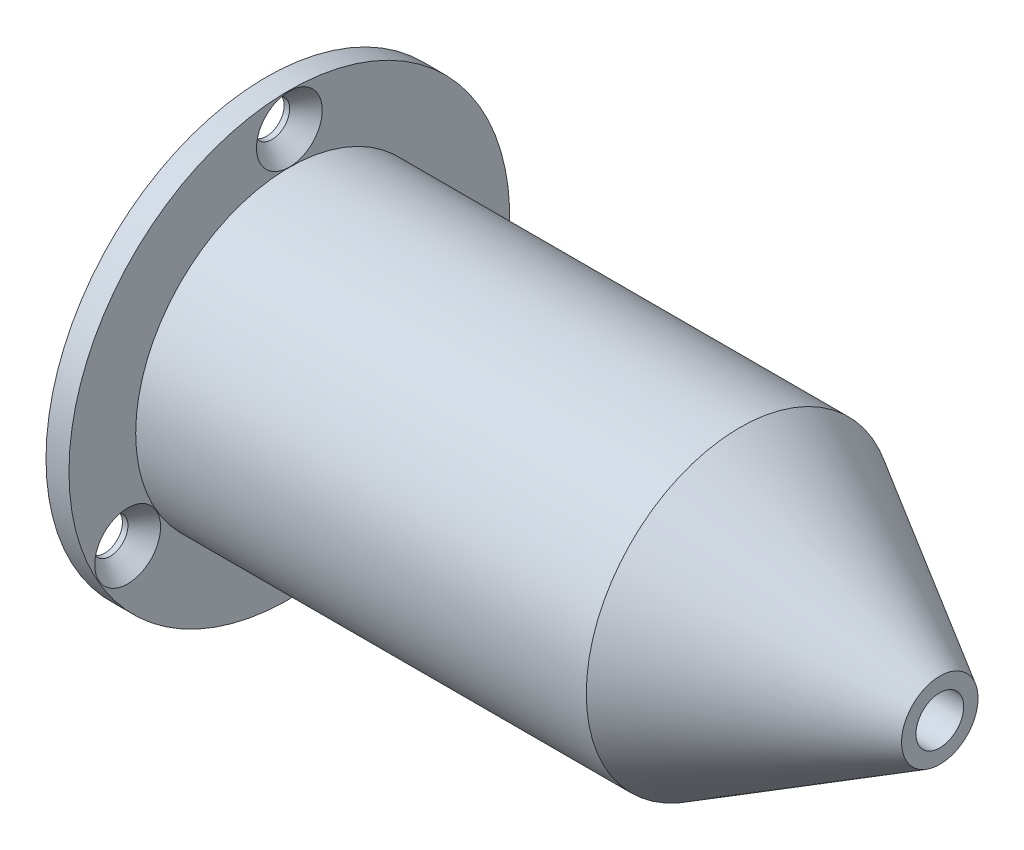
ISO-10303-21;
HEADER;
FILE_DESCRIPTION(('STEP AP214'),'2;1');
FILE_NAME('part.step','',(''),(''),'','','');
FILE_SCHEMA(('AUTOMOTIVE_DESIGN { 1 0 10303 214 1 1 1 1 }'));
ENDSEC;
DATA;
#1=APPLICATION_CONTEXT('core data for automotive mechanical design processes');
#2=APPLICATION_PROTOCOL_DEFINITION('international standard','automotive_design',2000,#1);
#3=PRODUCT_CONTEXT('',#1,'mechanical');
#4=PRODUCT('Part','Part','',(#3));
#5=PRODUCT_RELATED_PRODUCT_CATEGORY('part','',(#4));
#6=PRODUCT_DEFINITION_FORMATION('','',#4);
#7=PRODUCT_DEFINITION_CONTEXT('part definition',#1,'design');
#8=PRODUCT_DEFINITION('design','',#6,#7);
#9=PRODUCT_DEFINITION_SHAPE('','',#8);
#10=(LENGTH_UNIT() NAMED_UNIT(*) SI_UNIT(.MILLI.,.METRE.));
#11=(NAMED_UNIT(*) PLANE_ANGLE_UNIT() SI_UNIT($,.RADIAN.));
#12=(NAMED_UNIT(*) SI_UNIT($,.STERADIAN.) SOLID_ANGLE_UNIT());
#13=UNCERTAINTY_MEASURE_WITH_UNIT(LENGTH_MEASURE(1.E-05),#10,'distance_accuracy_value','');
#14=(GEOMETRIC_REPRESENTATION_CONTEXT(3) GLOBAL_UNCERTAINTY_ASSIGNED_CONTEXT((#13)) GLOBAL_UNIT_ASSIGNED_CONTEXT((#10,
#11,#12)) REPRESENTATION_CONTEXT('',''));
#15=CARTESIAN_POINT('',(0.,0.,0.));
#16=DIRECTION('',(0.,0.,1.));
#17=DIRECTION('',(1.,0.,0.));
#18=AXIS2_PLACEMENT_3D('',#15,#16,#17);
#19=CARTESIAN_POINT('',(38.142851058,0.,0.));
#20=DIRECTION('',(-1.,0.,0.));
#21=DIRECTION('',(0.,0.,1.));
#22=AXIS2_PLACEMENT_3D('',#19,#20,#21);
#23=CYLINDRICAL_SURFACE('',#22,12.2428);
#24=CARTESIAN_POINT('',(38.142851058,0.,0.));
#25=DIRECTION('',(-1.,0.,0.));
#26=DIRECTION('',(0.,0.,1.));
#27=AXIS2_PLACEMENT_3D('',#24,#25,#26);
#28=CIRCLE('',#27,12.2428);
#29=CARTESIAN_POINT('',(38.142851058,0.,12.2428));
#30=VERTEX_POINT('',#29);
#31=EDGE_CURVE('P0_E18',#30,#30,#28,.T.);
#32=ORIENTED_EDGE('',*,*,#31,.T.);
#33=EDGE_LOOP('',(#32));
#34=FACE_BOUND('',#33,.T.);
#35=CARTESIAN_POINT('',(38.1,0.,0.));
#36=DIRECTION('',(-1.,0.,0.));
#37=DIRECTION('',(0.,0.,1.));
#38=AXIS2_PLACEMENT_3D('',#35,#36,#37);
#39=CIRCLE('',#38,12.2428);
#40=CARTESIAN_POINT('',(38.1,0.,12.2428));
#41=VERTEX_POINT('',#40);
#42=EDGE_CURVE('P0_E32',#41,#41,#39,.F.);
#43=ORIENTED_EDGE('',*,*,#42,.T.);
#44=EDGE_LOOP('',(#43));
#45=FACE_BOUND('',#44,.T.);
#46=ADVANCED_FACE('P0_F14',(#34,#45),#23,.T.);
#47=CARTESIAN_POINT('',(38.142851058,-12.3897136,-12.3897136));
#48=DIRECTION('',(-1.,0.,0.));
#49=DIRECTION('',(0.,0.,1.));
#50=AXIS2_PLACEMENT_3D('',#47,#48,#49);
#51=PLANE('',#50);
#52=CARTESIAN_POINT('',(38.142851058,0.,0.));
#53=DIRECTION('',(1.,0.,0.));
#54=DIRECTION('',(0.,1.,0.));
#55=AXIS2_PLACEMENT_3D('',#52,#53,#54);
#56=CIRCLE('',#55,6.35);
#57=CARTESIAN_POINT('',(38.142851058,6.35,0.));
#58=VERTEX_POINT('',#57);
#59=EDGE_CURVE('P0_E23',#58,#58,#56,.T.);
#60=ORIENTED_EDGE('',*,*,#59,.F.);
#61=EDGE_LOOP('',(#60));
#62=FACE_BOUND('',#61,.T.);
#63=ORIENTED_EDGE('',*,*,#31,.F.);
#64=EDGE_LOOP('',(#63));
#65=FACE_BOUND('',#64,.T.);
#66=ADVANCED_FACE('P0_F41',(#62,#65),#51,.F.);
#67=CARTESIAN_POINT('',(38.1,-12.3897136,12.3897136));
#68=DIRECTION('',(1.,0.,0.));
#69=DIRECTION('',(0.,0.,-1.));
#70=AXIS2_PLACEMENT_3D('',#67,#68,#69);
#71=PLANE('',#70);
#72=CARTESIAN_POINT('',(38.1,0.,0.));
#73=DIRECTION('',(1.,0.,0.));
#74=DIRECTION('',(0.,1.,0.));
#75=AXIS2_PLACEMENT_3D('',#72,#73,#74);
#76=CIRCLE('',#75,6.35);
#77=CARTESIAN_POINT('',(38.1,6.35,0.));
#78=VERTEX_POINT('',#77);
#79=EDGE_CURVE('P0_E10',#78,#78,#76,.F.);
#80=ORIENTED_EDGE('',*,*,#79,.F.);
#81=EDGE_LOOP('',(#80));
#82=FACE_BOUND('',#81,.T.);
#83=ORIENTED_EDGE('',*,*,#42,.F.);
#84=EDGE_LOOP('',(#83));
#85=FACE_BOUND('',#84,.T.);
#86=ADVANCED_FACE('P0_F16',(#82,#85),#71,.F.);
#87=CARTESIAN_POINT('',(38.1,0.,0.));
#88=DIRECTION('',(1.,0.,0.));
#89=DIRECTION('',(0.,1.,0.));
#90=AXIS2_PLACEMENT_3D('',#87,#88,#89);
#91=CYLINDRICAL_SURFACE('',#90,6.35);
#92=ORIENTED_EDGE('',*,*,#79,.T.);
#93=EDGE_LOOP('',(#92));
#94=FACE_BOUND('',#93,.T.);
#95=ORIENTED_EDGE('',*,*,#59,.T.);
#96=EDGE_LOOP('',(#95));
#97=FACE_BOUND('',#96,.T.);
#98=ADVANCED_FACE('P0_F49',(#94,#97),#91,.F.);
#99=CLOSED_SHELL('',(#46,#66,#86,#98));
#100=MANIFOLD_SOLID_BREP('P0_B1',#99);
#101=CARTESIAN_POINT('',(42.592944206,-1.016225188,1.016225188));
#102=DIRECTION('',(1.,0.,0.));
#103=DIRECTION('',(0.,0.,-1.));
#104=AXIS2_PLACEMENT_3D('',#101,#102,#103);
#105=PLANE('',#104);
#106=CARTESIAN_POINT('',(42.592944206,0.,0.));
#107=DIRECTION('',(1.,0.,0.));
#108=DIRECTION('',(0.,0.,-1.));
#109=AXIS2_PLACEMENT_3D('',#106,#107,#108);
#110=CIRCLE('',#109,1.004175087);
#111=CARTESIAN_POINT('',(42.592944206,0.,-1.004175087));
#112=VERTEX_POINT('',#111);
#113=EDGE_CURVE('P1_E18',#112,#112,#110,.F.);
#114=ORIENTED_EDGE('',*,*,#113,.F.);
#115=EDGE_LOOP('',(#114));
#116=FACE_BOUND('',#115,.T.);
#117=ADVANCED_FACE('P1_F14',(#116),#105,.T.);
#118=CARTESIAN_POINT('',(42.592944206,0.,0.));
#119=DIRECTION('',(1.,0.,0.));
#120=DIRECTION('',(0.,0.,-1.));
#121=AXIS2_PLACEMENT_3D('',#118,#119,#120);
#122=CONICAL_SURFACE('',#121,1.004175087,1.02974425869962);
#123=CARTESIAN_POINT('',(43.18,0.,0.));
#124=DIRECTION('',(-1.,0.,0.));
#125=DIRECTION('',(0.,-1.,0.));
#126=AXIS2_PLACEMENT_3D('',#123,#124,#125);
#127=CIRCLE('',#126,1.9812);
#128=CARTESIAN_POINT('',(43.18,-1.9812,0.));
#129=VERTEX_POINT('',#128);
#130=EDGE_CURVE('P1_E36',#129,#129,#127,.T.);
#131=ORIENTED_EDGE('',*,*,#130,.F.);
#132=EDGE_LOOP('',(#131));
#133=FACE_BOUND('',#132,.T.);
#134=ORIENTED_EDGE('',*,*,#113,.T.);
#135=EDGE_LOOP('',(#134));
#136=FACE_BOUND('',#135,.T.);
#137=ADVANCED_FACE('P1_F95',(#133,#136),#122,.F.);
#138=CARTESIAN_POINT('',(55.88,0.,0.));
#139=DIRECTION('',(-1.,0.,0.));
#140=DIRECTION('',(0.,0.,1.));
#141=AXIS2_PLACEMENT_3D('',#138,#139,#140);
#142=CYLINDRICAL_SURFACE('',#141,1.9812);
#143=ORIENTED_EDGE('',*,*,#130,.T.);
#144=EDGE_LOOP('',(#143));
#145=FACE_BOUND('',#144,.T.);
#146=CARTESIAN_POINT('',(55.88,0.,0.));
#147=DIRECTION('',(-1.,0.,0.));
#148=DIRECTION('',(0.,0.,1.));
#149=AXIS2_PLACEMENT_3D('',#146,#147,#148);
#150=CIRCLE('',#149,1.9812);
#151=CARTESIAN_POINT('',(55.88,0.,1.9812));
#152=VERTEX_POINT('',#151);
#153=EDGE_CURVE('P1_E83',#152,#152,#150,.T.);
#154=ORIENTED_EDGE('',*,*,#153,.F.);
#155=EDGE_LOOP('',(#154));
#156=FACE_BOUND('',#155,.T.);
#157=ADVANCED_FACE('P1_F103',(#145,#156),#142,.F.);
#158=CARTESIAN_POINT('',(55.88,-3.213100005,3.213100005));
#159=DIRECTION('',(1.,0.,0.));
#160=DIRECTION('',(0.,0.,-1.));
#161=AXIS2_PLACEMENT_3D('',#158,#159,#160);
#162=PLANE('',#161);
#163=ORIENTED_EDGE('',*,*,#153,.T.);
#164=EDGE_LOOP('',(#163));
#165=FACE_BOUND('',#164,.T.);
#166=CARTESIAN_POINT('',(55.880000003,0.,0.));
#167=DIRECTION('',(-1.,0.,0.));
#168=DIRECTION('',(0.,0.,1.));
#169=AXIS2_PLACEMENT_3D('',#166,#167,#168);
#170=CIRCLE('',#169,3.17500000500001);
#171=CARTESIAN_POINT('',(55.880000003,0.,3.17500000500001));
#172=VERTEX_POINT('',#171);
#173=EDGE_CURVE('P1_E80',#172,#172,#170,.F.);
#174=ORIENTED_EDGE('',*,*,#173,.T.);
#175=EDGE_LOOP('',(#174));
#176=FACE_BOUND('',#175,.T.);
#177=ADVANCED_FACE('P1_F160',(#165,#176),#162,.T.);
#178=CARTESIAN_POINT('',(55.880000003,0.,0.));
#179=DIRECTION('',(-1.,0.,0.));
#180=DIRECTION('',(0.,0.,1.));
#181=AXIS2_PLACEMENT_3D('',#178,#179,#180);
#182=CONICAL_SURFACE('',#181,3.175000005,0.523598774980425);
#183=CARTESIAN_POINT('',(39.294227877,0.,0.));
#184=DIRECTION('',(-1.,0.,0.));
#185=DIRECTION('',(0.,0.,1.));
#186=AXIS2_PLACEMENT_3D('',#183,#184,#185);
#187=CIRCLE('',#186,12.7508);
#188=CARTESIAN_POINT('',(39.294227877,0.,12.7508));
#189=VERTEX_POINT('',#188);
#190=EDGE_CURVE('P1_E79',#189,#189,#187,.F.);
#191=ORIENTED_EDGE('',*,*,#190,.T.);
#192=EDGE_LOOP('',(#191));
#193=FACE_BOUND('',#192,.T.);
#194=ORIENTED_EDGE('',*,*,#173,.F.);
#195=EDGE_LOOP('',(#194));
#196=FACE_BOUND('',#195,.T.);
#197=ADVANCED_FACE('P1_F156',(#193,#196),#182,.T.);
#198=CARTESIAN_POINT('',(39.294227877,0.,0.));
#199=DIRECTION('',(-1.,0.,0.));
#200=DIRECTION('',(0.,0.,1.));
#201=AXIS2_PLACEMENT_3D('',#198,#199,#200);
#202=CYLINDRICAL_SURFACE('',#201,12.7508);
#203=CARTESIAN_POINT('',(1.905,0.,0.));
#204=DIRECTION('',(-1.,0.,0.));
#205=DIRECTION('',(0.,0.,1.));
#206=AXIS2_PLACEMENT_3D('',#203,#204,#205);
#207=CIRCLE('',#206,12.7508);
#208=CARTESIAN_POINT('',(1.905,0.,12.7508));
#209=VERTEX_POINT('',#208);
#210=EDGE_CURVE('P1_E75',#209,#209,#207,.T.);
#211=ORIENTED_EDGE('',*,*,#210,.F.);
#212=EDGE_LOOP('',(#211));
#213=FACE_BOUND('',#212,.T.);
#214=ORIENTED_EDGE('',*,*,#190,.F.);
#215=EDGE_LOOP('',(#214));
#216=FACE_BOUND('',#215,.T.);
#217=ADVANCED_FACE('P1_F153',(#213,#216),#202,.T.);
#218=CARTESIAN_POINT('',(1.905,-18.507456,18.507456));
#219=DIRECTION('',(1.,0.,0.));
#220=DIRECTION('',(0.,0.,-1.));
#221=AXIS2_PLACEMENT_3D('',#218,#219,#220);
#222=PLANE('',#221);
#223=CARTESIAN_POINT('',(1.90499999999993,-7.747,13.418197606));
#224=DIRECTION('',(1.,0.,0.));
#225=DIRECTION('',(0.,0.,-1.));
#226=AXIS2_PLACEMENT_3D('',#223,#224,#225);
#227=CIRCLE('',#226,2.73049999999994);
#228=CARTESIAN_POINT('',(1.90499999999993,-7.747,10.6876976060001));
#229=VERTEX_POINT('',#228);
#230=EDGE_CURVE('P1_E63',#229,#229,#227,.T.);
#231=ORIENTED_EDGE('',*,*,#230,.F.);
#232=EDGE_LOOP('',(#231));
#233=FACE_BOUND('',#232,.T.);
#234=CARTESIAN_POINT('',(1.90499999999993,-7.747,-13.418197606));
#235=DIRECTION('',(1.,0.,0.));
#236=DIRECTION('',(0.,0.,-1.));
#237=AXIS2_PLACEMENT_3D('',#234,#235,#236);
#238=CIRCLE('',#237,2.73049999999994);
#239=CARTESIAN_POINT('',(1.90499999999993,-7.747,-16.1486976059999));
#240=VERTEX_POINT('',#239);
#241=EDGE_CURVE('P1_E67',#240,#240,#238,.T.);
#242=ORIENTED_EDGE('',*,*,#241,.F.);
#243=EDGE_LOOP('',(#242));
#244=FACE_BOUND('',#243,.T.);
#245=CARTESIAN_POINT('',(1.90499999999993,15.494,0.));
#246=DIRECTION('',(1.,0.,0.));
#247=DIRECTION('',(0.,0.,-1.));
#248=AXIS2_PLACEMENT_3D('',#245,#246,#247);
#249=CIRCLE('',#248,2.73049999999994);
#250=CARTESIAN_POINT('',(1.90499999999993,15.494,-2.73049999999994));
#251=VERTEX_POINT('',#250);
#252=EDGE_CURVE('P1_E71',#251,#251,#249,.T.);
#253=ORIENTED_EDGE('',*,*,#252,.F.);
#254=EDGE_LOOP('',(#253));
#255=FACE_BOUND('',#254,.T.);
#256=ORIENTED_EDGE('',*,*,#210,.T.);
#257=EDGE_LOOP('',(#256));
#258=FACE_BOUND('',#257,.T.);
#259=CARTESIAN_POINT('',(1.905,0.,0.));
#260=DIRECTION('',(-1.,0.,0.));
#261=DIRECTION('',(0.,0.,1.));
#262=AXIS2_PLACEMENT_3D('',#259,#260,#261);
#263=CIRCLE('',#262,18.288);
#264=CARTESIAN_POINT('',(1.905,0.,18.288));
#265=VERTEX_POINT('',#264);
#266=EDGE_CURVE('P1_E58',#265,#265,#263,.F.);
#267=ORIENTED_EDGE('',*,*,#266,.T.);
#268=EDGE_LOOP('',(#267));
#269=FACE_BOUND('',#268,.T.);
#270=ADVANCED_FACE('P1_F151',(#233,#244,#255,#258,#269),#222,.T.);
#271=CARTESIAN_POINT('',(0.458641802,15.494,0.));
#272=DIRECTION('',(1.,0.,0.));
#273=DIRECTION('',(0.,0.,-1.));
#274=AXIS2_PLACEMENT_3D('',#271,#272,#273);
#275=CONICAL_SURFACE('',#274,1.4732,0.715584993454257);
#276=CARTESIAN_POINT('',(0.458641802,15.494,0.));
#277=DIRECTION('',(-1.,0.,0.));
#278=DIRECTION('',(0.,0.,1.));
#279=AXIS2_PLACEMENT_3D('',#276,#277,#278);
#280=CIRCLE('',#279,1.4732);
#281=CARTESIAN_POINT('',(0.458641802,15.494,1.4732));
#282=VERTEX_POINT('',#281);
#283=EDGE_CURVE('P1_E62',#282,#282,#280,.F.);
#284=ORIENTED_EDGE('',*,*,#283,.F.);
#285=EDGE_LOOP('',(#284));
#286=FACE_BOUND('',#285,.T.);
#287=ORIENTED_EDGE('',*,*,#252,.T.);
#288=EDGE_LOOP('',(#287));
#289=FACE_BOUND('',#288,.T.);
#290=ADVANCED_FACE('P1_F147',(#286,#289),#275,.F.);
#291=CARTESIAN_POINT('',(0.458641802,-7.747,-13.418197606));
#292=DIRECTION('',(1.,0.,0.));
#293=DIRECTION('',(0.,0.,-1.));
#294=AXIS2_PLACEMENT_3D('',#291,#292,#293);
#295=CONICAL_SURFACE('',#294,1.4732,0.715584993454257);
#296=CARTESIAN_POINT('',(0.458641802,-7.747,-13.418197606));
#297=DIRECTION('',(-1.,0.,0.));
#298=DIRECTION('',(0.,0.,1.));
#299=AXIS2_PLACEMENT_3D('',#296,#297,#298);
#300=CIRCLE('',#299,1.4732);
#301=CARTESIAN_POINT('',(0.458641802,-7.747,-11.944997606));
#302=VERTEX_POINT('',#301);
#303=EDGE_CURVE('P1_E321',#302,#302,#300,.F.);
#304=ORIENTED_EDGE('',*,*,#303,.F.);
#305=EDGE_LOOP('',(#304));
#306=FACE_BOUND('',#305,.T.);
#307=ORIENTED_EDGE('',*,*,#241,.T.);
#308=EDGE_LOOP('',(#307));
#309=FACE_BOUND('',#308,.T.);
#310=ADVANCED_FACE('P1_F143',(#306,#309),#295,.F.);
#311=CARTESIAN_POINT('',(0.458641802,-7.747,13.418197606));
#312=DIRECTION('',(1.,0.,0.));
#313=DIRECTION('',(0.,0.,-1.));
#314=AXIS2_PLACEMENT_3D('',#311,#312,#313);
#315=CONICAL_SURFACE('',#314,1.4732,0.715584993454256);
#316=CARTESIAN_POINT('',(0.458641802,-7.747,13.418197606));
#317=DIRECTION('',(-1.,0.,0.));
#318=DIRECTION('',(0.,0.,1.));
#319=AXIS2_PLACEMENT_3D('',#316,#317,#318);
#320=CIRCLE('',#319,1.4732);
#321=CARTESIAN_POINT('',(0.458641802,-7.747,14.891397606));
#322=VERTEX_POINT('',#321);
#323=EDGE_CURVE('P1_E57',#322,#322,#320,.F.);
#324=ORIENTED_EDGE('',*,*,#323,.F.);
#325=EDGE_LOOP('',(#324));
#326=FACE_BOUND('',#325,.T.);
#327=ORIENTED_EDGE('',*,*,#230,.T.);
#328=EDGE_LOOP('',(#327));
#329=FACE_BOUND('',#328,.T.);
#330=ADVANCED_FACE('P1_F140',(#326,#329),#315,.F.);
#331=CARTESIAN_POINT('',(1.5875,-12.3897136,-12.3897136));
#332=DIRECTION('',(-1.,0.,0.));
#333=DIRECTION('',(0.,0.,1.));
#334=AXIS2_PLACEMENT_3D('',#331,#332,#333);
#335=PLANE('',#334);
#336=CARTESIAN_POINT('',(1.5875,0.,0.));
#337=DIRECTION('',(-1.,0.,0.));
#338=DIRECTION('',(0.,0.,1.));
#339=AXIS2_PLACEMENT_3D('',#336,#337,#338);
#340=CIRCLE('',#339,12.2428);
#341=CARTESIAN_POINT('',(1.5875,0.,12.2428));
#342=VERTEX_POINT('',#341);
#343=EDGE_CURVE('P1_E53',#342,#342,#340,.F.);
#344=ORIENTED_EDGE('',*,*,#343,.F.);
#345=EDGE_LOOP('',(#344));
#346=FACE_BOUND('',#345,.T.);
#347=ADVANCED_FACE('P1_F138',(#346),#335,.T.);
#348=CARTESIAN_POINT('',(1.905,0.,0.));
#349=DIRECTION('',(-1.,0.,0.));
#350=DIRECTION('',(0.,0.,1.));
#351=AXIS2_PLACEMENT_3D('',#348,#349,#350);
#352=CYLINDRICAL_SURFACE('',#351,18.288);
#353=CARTESIAN_POINT('',(0.,0.,0.));
#354=DIRECTION('',(-1.,0.,0.));
#355=DIRECTION('',(0.,0.,1.));
#356=AXIS2_PLACEMENT_3D('',#353,#354,#355);
#357=CIRCLE('',#356,18.288);
#358=CARTESIAN_POINT('',(0.,0.,18.288));
#359=VERTEX_POINT('',#358);
#360=EDGE_CURVE('P1_E49',#359,#359,#357,.T.);
#361=ORIENTED_EDGE('',*,*,#360,.F.);
#362=EDGE_LOOP('',(#361));
#363=FACE_BOUND('',#362,.T.);
#364=ORIENTED_EDGE('',*,*,#266,.F.);
#365=EDGE_LOOP('',(#364));
#366=FACE_BOUND('',#365,.T.);
#367=ADVANCED_FACE('P1_F134',(#363,#366),#352,.T.);
#368=CARTESIAN_POINT('',(0.458641802,15.494,0.));
#369=DIRECTION('',(-1.,0.,0.));
#370=DIRECTION('',(0.,0.,1.));
#371=AXIS2_PLACEMENT_3D('',#368,#369,#370);
#372=CYLINDRICAL_SURFACE('',#371,1.4732);
#373=ORIENTED_EDGE('',*,*,#283,.T.);
#374=EDGE_LOOP('',(#373));
#375=FACE_BOUND('',#374,.T.);
#376=CARTESIAN_POINT('',(0.,15.494,0.));
#377=DIRECTION('',(-1.,0.,0.));
#378=DIRECTION('',(0.,0.,1.));
#379=AXIS2_PLACEMENT_3D('',#376,#377,#378);
#380=CIRCLE('',#379,1.4732);
#381=CARTESIAN_POINT('',(0.,15.494,1.4732));
#382=VERTEX_POINT('',#381);
#383=EDGE_CURVE('P1_E45',#382,#382,#380,.F.);
#384=ORIENTED_EDGE('',*,*,#383,.F.);
#385=EDGE_LOOP('',(#384));
#386=FACE_BOUND('',#385,.T.);
#387=ADVANCED_FACE('P1_F130',(#375,#386),#372,.F.);
#388=CARTESIAN_POINT('',(0.458641802,-7.747,-13.418197606));
#389=DIRECTION('',(-1.,0.,0.));
#390=DIRECTION('',(0.,0.,1.));
#391=AXIS2_PLACEMENT_3D('',#388,#389,#390);
#392=CYLINDRICAL_SURFACE('',#391,1.4732);
#393=ORIENTED_EDGE('',*,*,#303,.T.);
#394=EDGE_LOOP('',(#393));
#395=FACE_BOUND('',#394,.T.);
#396=CARTESIAN_POINT('',(0.,-7.747,-13.418197606));
#397=DIRECTION('',(-1.,0.,0.));
#398=DIRECTION('',(0.,0.,1.));
#399=AXIS2_PLACEMENT_3D('',#396,#397,#398);
#400=CIRCLE('',#399,1.4732);
#401=CARTESIAN_POINT('',(0.,-7.747,-11.944997606));
#402=VERTEX_POINT('',#401);
#403=EDGE_CURVE('P1_E41',#402,#402,#400,.F.);
#404=ORIENTED_EDGE('',*,*,#403,.F.);
#405=EDGE_LOOP('',(#404));
#406=FACE_BOUND('',#405,.T.);
#407=ADVANCED_FACE('P1_F124',(#395,#406),#392,.F.);
#408=CARTESIAN_POINT('',(0.458641802,-7.747,13.418197606));
#409=DIRECTION('',(-1.,0.,0.));
#410=DIRECTION('',(0.,0.,1.));
#411=AXIS2_PLACEMENT_3D('',#408,#409,#410);
#412=CYLINDRICAL_SURFACE('',#411,1.4732);
#413=ORIENTED_EDGE('',*,*,#323,.T.);
#414=EDGE_LOOP('',(#413));
#415=FACE_BOUND('',#414,.T.);
#416=CARTESIAN_POINT('',(0.,-7.747,13.418197606));
#417=DIRECTION('',(-1.,0.,0.));
#418=DIRECTION('',(0.,0.,1.));
#419=AXIS2_PLACEMENT_3D('',#416,#417,#418);
#420=CIRCLE('',#419,1.4732);
#421=CARTESIAN_POINT('',(0.,-7.747,14.891397606));
#422=VERTEX_POINT('',#421);
#423=EDGE_CURVE('P1_E32',#422,#422,#420,.F.);
#424=ORIENTED_EDGE('',*,*,#423,.F.);
#425=EDGE_LOOP('',(#424));
#426=FACE_BOUND('',#425,.T.);
#427=ADVANCED_FACE('P1_F118',(#415,#426),#412,.F.);
#428=CARTESIAN_POINT('',(1.5875,0.,0.));
#429=DIRECTION('',(-1.,0.,0.));
#430=DIRECTION('',(0.,0.,1.));
#431=AXIS2_PLACEMENT_3D('',#428,#429,#430);
#432=CYLINDRICAL_SURFACE('',#431,12.2428);
#433=ORIENTED_EDGE('',*,*,#343,.T.);
#434=EDGE_LOOP('',(#433));
#435=FACE_BOUND('',#434,.T.);
#436=CARTESIAN_POINT('',(0.396875,0.,0.));
#437=DIRECTION('',(1.,0.,0.));
#438=DIRECTION('',(0.,0.,-1.));
#439=AXIS2_PLACEMENT_3D('',#436,#437,#438);
#440=CIRCLE('',#439,12.2428);
#441=CARTESIAN_POINT('',(0.396875,0.,-12.2428));
#442=VERTEX_POINT('',#441);
#443=EDGE_CURVE('P1_E23',#442,#442,#440,.T.);
#444=ORIENTED_EDGE('',*,*,#443,.F.);
#445=EDGE_LOOP('',(#444));
#446=FACE_BOUND('',#445,.T.);
#447=ADVANCED_FACE('P1_F113',(#435,#446),#432,.F.);
#448=CARTESIAN_POINT('',(0.,-18.507456,-18.507456));
#449=DIRECTION('',(-1.,0.,0.));
#450=DIRECTION('',(0.,0.,1.));
#451=AXIS2_PLACEMENT_3D('',#448,#449,#450);
#452=PLANE('',#451);
#453=ORIENTED_EDGE('',*,*,#423,.T.);
#454=EDGE_LOOP('',(#453));
#455=FACE_BOUND('',#454,.T.);
#456=ORIENTED_EDGE('',*,*,#403,.T.);
#457=EDGE_LOOP('',(#456));
#458=FACE_BOUND('',#457,.T.);
#459=ORIENTED_EDGE('',*,*,#383,.T.);
#460=EDGE_LOOP('',(#459));
#461=FACE_BOUND('',#460,.T.);
#462=CARTESIAN_POINT('',(0.,0.,0.));
#463=DIRECTION('',(-1.,0.,0.));
#464=DIRECTION('',(0.,0.,1.));
#465=AXIS2_PLACEMENT_3D('',#462,#463,#464);
#466=CIRCLE('',#465,12.639675);
#467=CARTESIAN_POINT('',(0.,0.,12.639675));
#468=VERTEX_POINT('',#467);
#469=EDGE_CURVE('P1_E10',#468,#468,#466,.T.);
#470=ORIENTED_EDGE('',*,*,#469,.F.);
#471=EDGE_LOOP('',(#470));
#472=FACE_BOUND('',#471,.T.);
#473=ORIENTED_EDGE('',*,*,#360,.T.);
#474=EDGE_LOOP('',(#473));
#475=FACE_BOUND('',#474,.T.);
#476=ADVANCED_FACE('P1_F108',(#455,#458,#461,#472,#475),#452,.T.);
#477=CARTESIAN_POINT('',(0.396874999999997,0.,0.));
#478=DIRECTION('',(-1.,0.,0.));
#479=DIRECTION('',(0.,0.,1.));
#480=AXIS2_PLACEMENT_3D('',#477,#478,#479);
#481=TOROIDAL_SURFACE('',#480,12.639675,0.396874999999998);
#482=ORIENTED_EDGE('',*,*,#443,.T.);
#483=EDGE_LOOP('',(#482));
#484=FACE_BOUND('',#483,.T.);
#485=ORIENTED_EDGE('',*,*,#469,.T.);
#486=EDGE_LOOP('',(#485));
#487=FACE_BOUND('',#486,.T.);
#488=ADVANCED_FACE('P1_F16',(#484,#487),#481,.T.);
#489=CLOSED_SHELL('',(#117,#137,#157,#177,#197,#217,#270,#290,#310,#330,#347,#367,#387,#407,
#427,#447,#476,#488));
#490=MANIFOLD_SOLID_BREP('P1_B1',#489);
#491=ADVANCED_BREP_SHAPE_REPRESENTATION('',(#18,#100,#490),#14);
#492=SHAPE_DEFINITION_REPRESENTATION(#9,#491);
ENDSEC;
END-ISO-10303-21;
